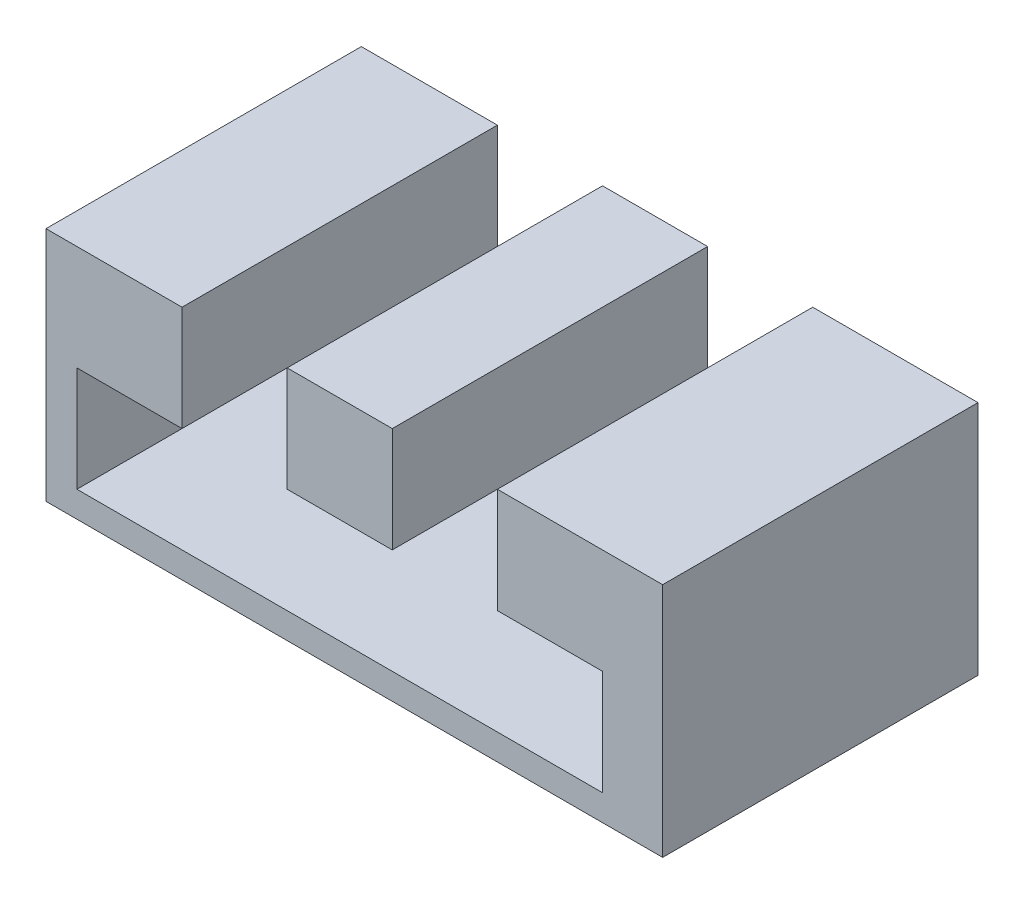
ISO-10303-21;
HEADER;
FILE_DESCRIPTION(('STEP AP214'),'2;1');
FILE_NAME('part.step','',(''),(''),'','','');
FILE_SCHEMA(('AUTOMOTIVE_DESIGN { 1 0 10303 214 1 1 1 1 }'));
ENDSEC;
DATA;
#1=APPLICATION_CONTEXT('core data for automotive mechanical design processes');
#2=APPLICATION_PROTOCOL_DEFINITION('international standard','automotive_design',2000,#1);
#3=PRODUCT_CONTEXT('',#1,'mechanical');
#4=PRODUCT('Part','Part','',(#3));
#5=PRODUCT_RELATED_PRODUCT_CATEGORY('part','',(#4));
#6=PRODUCT_DEFINITION_FORMATION('','',#4);
#7=PRODUCT_DEFINITION_CONTEXT('part definition',#1,'design');
#8=PRODUCT_DEFINITION('design','',#6,#7);
#9=PRODUCT_DEFINITION_SHAPE('','',#8);
#10=(LENGTH_UNIT() NAMED_UNIT(*) SI_UNIT(.MILLI.,.METRE.));
#11=(NAMED_UNIT(*) PLANE_ANGLE_UNIT() SI_UNIT($,.RADIAN.));
#12=(NAMED_UNIT(*) SI_UNIT($,.STERADIAN.) SOLID_ANGLE_UNIT());
#13=UNCERTAINTY_MEASURE_WITH_UNIT(LENGTH_MEASURE(1.E-05),#10,'distance_accuracy_value','');
#14=(GEOMETRIC_REPRESENTATION_CONTEXT(3) GLOBAL_UNCERTAINTY_ASSIGNED_CONTEXT((#13)) GLOBAL_UNIT_ASSIGNED_CONTEXT((#10,
#11,#12)) REPRESENTATION_CONTEXT('',''));
#15=CARTESIAN_POINT('',(0.,0.,0.));
#16=DIRECTION('',(0.,0.,1.));
#17=DIRECTION('',(1.,0.,0.));
#18=AXIS2_PLACEMENT_3D('',#15,#16,#17);
#19=CARTESIAN_POINT('',(-2.94320706898933,20.,30.));
#20=DIRECTION('',(0.,-1.,0.));
#21=DIRECTION('',(0.,0.,-1.));
#22=AXIS2_PLACEMENT_3D('',#19,#20,#21);
#23=PLANE('',#22);
#24=DIRECTION('',(0.,0.,-1.));
#25=VECTOR('',#24,1.);
#26=CARTESIAN_POINT('',(40.,20.,30.));
#27=LINE('',#26,#25);
#28=CARTESIAN_POINT('',(40.,20.,30.));
#29=VERTEX_POINT('',#28);
#30=CARTESIAN_POINT('',(40.,20.,0.));
#31=VERTEX_POINT('',#30);
#32=EDGE_CURVE('E206',#29,#31,#27,.T.);
#33=ORIENTED_EDGE('',*,*,#32,.F.);
#34=DIRECTION('',(-1.,0.,0.));
#35=VECTOR('',#34,1.);
#36=CARTESIAN_POINT('',(-2.94320706898933,20.,30.));
#37=LINE('',#36,#35);
#38=CARTESIAN_POINT('',(55.7217406532504,20.,30.));
#39=VERTEX_POINT('',#38);
#40=EDGE_CURVE('E159',#39,#29,#37,.T.);
#41=ORIENTED_EDGE('',*,*,#40,.F.);
#42=DIRECTION('',(0.,0.,-1.));
#43=VECTOR('',#42,1.);
#44=CARTESIAN_POINT('',(55.7217406532504,20.,30.));
#45=LINE('',#44,#43);
#46=CARTESIAN_POINT('',(55.7217406532504,20.,0.));
#47=VERTEX_POINT('',#46);
#48=EDGE_CURVE('E184',#39,#47,#45,.T.);
#49=ORIENTED_EDGE('',*,*,#48,.T.);
#50=DIRECTION('',(-1.,0.,0.));
#51=VECTOR('',#50,1.);
#52=CARTESIAN_POINT('',(-2.94320706898933,20.,0.));
#53=LINE('',#52,#51);
#54=EDGE_CURVE('E46',#47,#31,#53,.T.);
#55=ORIENTED_EDGE('',*,*,#54,.T.);
#56=EDGE_LOOP('',(#33,#41,#49,#55));
#57=FACE_BOUND('',#56,.T.);
#58=ADVANCED_FACE('F43',(#57),#23,.F.);
#59=DIRECTION('',(0.,0.,-1.));
#60=VECTOR('',#59,1.);
#61=CARTESIAN_POINT('',(10.,20.,30.));
#62=LINE('',#61,#60);
#63=CARTESIAN_POINT('',(10.,20.,30.));
#64=VERTEX_POINT('',#63);
#65=CARTESIAN_POINT('',(10.,20.,0.));
#66=VERTEX_POINT('',#65);
#67=EDGE_CURVE('E177',#64,#66,#62,.T.);
#68=ORIENTED_EDGE('',*,*,#67,.T.);
#69=CARTESIAN_POINT('',(-2.94320706898933,20.,0.));
#70=VERTEX_POINT('',#69);
#71=EDGE_CURVE('E171',#66,#70,#53,.T.);
#72=ORIENTED_EDGE('',*,*,#71,.T.);
#73=DIRECTION('',(0.,0.,-1.));
#74=VECTOR('',#73,1.);
#75=CARTESIAN_POINT('',(-2.94320706898933,20.,30.));
#76=LINE('',#75,#74);
#77=CARTESIAN_POINT('',(-2.94320706898933,20.,30.));
#78=VERTEX_POINT('',#77);
#79=EDGE_CURVE('E195',#78,#70,#76,.T.);
#80=ORIENTED_EDGE('',*,*,#79,.F.);
#81=EDGE_CURVE('E163',#64,#78,#37,.T.);
#82=ORIENTED_EDGE('',*,*,#81,.F.);
#83=EDGE_LOOP('',(#68,#72,#80,#82));
#84=FACE_BOUND('',#83,.T.);
#85=ADVANCED_FACE('F233',(#84),#23,.F.);
#86=CARTESIAN_POINT('',(0.,0.,30.));
#87=DIRECTION('',(0.,0.,-1.));
#88=DIRECTION('',(-1.,0.,0.));
#89=AXIS2_PLACEMENT_3D('',#86,#87,#88);
#90=PLANE('',#89);
#91=DIRECTION('',(0.,1.,0.));
#92=VECTOR('',#91,1.);
#93=CARTESIAN_POINT('',(40.,10.,30.));
#94=LINE('',#93,#92);
#95=CARTESIAN_POINT('',(40.,10.,30.));
#96=VERTEX_POINT('',#95);
#97=EDGE_CURVE('E207',#96,#29,#94,.T.);
#98=ORIENTED_EDGE('',*,*,#97,.F.);
#99=DIRECTION('',(-1.,0.,0.));
#100=VECTOR('',#99,1.);
#101=CARTESIAN_POINT('',(50.,10.,30.));
#102=LINE('',#101,#100);
#103=CARTESIAN_POINT('',(50.,10.,30.));
#104=VERTEX_POINT('',#103);
#105=EDGE_CURVE('E151',#104,#96,#102,.T.);
#106=ORIENTED_EDGE('',*,*,#105,.F.);
#107=DIRECTION('',(0.,1.,0.));
#108=VECTOR('',#107,1.);
#109=CARTESIAN_POINT('',(50.,0.,30.));
#110=LINE('',#109,#108);
#111=CARTESIAN_POINT('',(50.,0.,30.));
#112=VERTEX_POINT('',#111);
#113=EDGE_CURVE('E142',#112,#104,#110,.T.);
#114=ORIENTED_EDGE('',*,*,#113,.F.);
#115=DIRECTION('',(1.,0.,0.));
#116=VECTOR('',#115,1.);
#117=CARTESIAN_POINT('',(0.,0.,30.));
#118=LINE('',#117,#116);
#119=CARTESIAN_POINT('',(0.,0.,30.));
#120=VERTEX_POINT('',#119);
#121=EDGE_CURVE('E131',#120,#112,#118,.T.);
#122=ORIENTED_EDGE('',*,*,#121,.F.);
#123=DIRECTION('',(0.,-1.,0.));
#124=VECTOR('',#123,1.);
#125=CARTESIAN_POINT('',(0.,10.,30.));
#126=LINE('',#125,#124);
#127=CARTESIAN_POINT('',(0.,10.,30.));
#128=VERTEX_POINT('',#127);
#129=EDGE_CURVE('E51',#128,#120,#126,.T.);
#130=ORIENTED_EDGE('',*,*,#129,.F.);
#131=DIRECTION('',(-1.,0.,0.));
#132=VECTOR('',#131,1.);
#133=CARTESIAN_POINT('',(10.,10.,30.));
#134=LINE('',#133,#132);
#135=CARTESIAN_POINT('',(10.,10.,30.));
#136=VERTEX_POINT('',#135);
#137=EDGE_CURVE('E214',#136,#128,#134,.T.);
#138=ORIENTED_EDGE('',*,*,#137,.F.);
#139=DIRECTION('',(0.,-1.,0.));
#140=VECTOR('',#139,1.);
#141=CARTESIAN_POINT('',(10.,20.,30.));
#142=LINE('',#141,#140);
#143=EDGE_CURVE('E211',#64,#136,#142,.T.);
#144=ORIENTED_EDGE('',*,*,#143,.F.);
#145=ORIENTED_EDGE('',*,*,#81,.T.);
#146=DIRECTION('',(0.,-1.,0.));
#147=VECTOR('',#146,1.);
#148=CARTESIAN_POINT('',(-2.94320706898933,-2.47182688389919,30.));
#149=LINE('',#148,#147);
#150=CARTESIAN_POINT('',(-2.94320706898933,-2.47182688389919,30.));
#151=VERTEX_POINT('',#150);
#152=EDGE_CURVE('E170',#78,#151,#149,.T.);
#153=ORIENTED_EDGE('',*,*,#152,.T.);
#154=DIRECTION('',(1.,0.,0.));
#155=VECTOR('',#154,1.);
#156=CARTESIAN_POINT('',(-2.94320706898933,-2.47182688389919,30.));
#157=LINE('',#156,#155);
#158=CARTESIAN_POINT('',(55.7217406532504,-2.47182688389919,30.));
#159=VERTEX_POINT('',#158);
#160=EDGE_CURVE('E168',#151,#159,#157,.T.);
#161=ORIENTED_EDGE('',*,*,#160,.T.);
#162=DIRECTION('',(0.,1.,0.));
#163=VECTOR('',#162,1.);
#164=CARTESIAN_POINT('',(55.7217406532504,-2.47182688389919,30.));
#165=LINE('',#164,#163);
#166=EDGE_CURVE('E162',#159,#39,#165,.T.);
#167=ORIENTED_EDGE('',*,*,#166,.T.);
#168=ORIENTED_EDGE('',*,*,#40,.T.);
#169=EDGE_LOOP('',(#98,#106,#114,#122,#130,#138,#144,#145,#153,#161,#167,#168));
#170=FACE_BOUND('',#169,.T.);
#171=ADVANCED_FACE('F150',(#170),#90,.F.);
#172=CARTESIAN_POINT('',(0.,0.,0.));
#173=DIRECTION('',(0.,0.,-1.));
#174=DIRECTION('',(-1.,0.,0.));
#175=AXIS2_PLACEMENT_3D('',#172,#173,#174);
#176=PLANE('',#175);
#177=DIRECTION('',(-1.,0.,0.));
#178=VECTOR('',#177,1.);
#179=CARTESIAN_POINT('',(50.,10.,0.));
#180=LINE('',#179,#178);
#181=CARTESIAN_POINT('',(50.,10.,0.));
#182=VERTEX_POINT('',#181);
#183=CARTESIAN_POINT('',(40.,10.,0.));
#184=VERTEX_POINT('',#183);
#185=EDGE_CURVE('E161',#182,#184,#180,.T.);
#186=ORIENTED_EDGE('',*,*,#185,.T.);
#187=DIRECTION('',(0.,1.,0.));
#188=VECTOR('',#187,1.);
#189=CARTESIAN_POINT('',(40.,10.,0.));
#190=LINE('',#189,#188);
#191=EDGE_CURVE('E166',#184,#31,#190,.T.);
#192=ORIENTED_EDGE('',*,*,#191,.T.);
#193=ORIENTED_EDGE('',*,*,#54,.F.);
#194=DIRECTION('',(0.,1.,0.));
#195=VECTOR('',#194,1.);
#196=CARTESIAN_POINT('',(55.7217406532504,-2.47182688389919,0.));
#197=LINE('',#196,#195);
#198=CARTESIAN_POINT('',(55.7217406532504,-2.47182688389919,0.));
#199=VERTEX_POINT('',#198);
#200=EDGE_CURVE('E199',#199,#47,#197,.T.);
#201=ORIENTED_EDGE('',*,*,#200,.F.);
#202=DIRECTION('',(1.,0.,0.));
#203=VECTOR('',#202,1.);
#204=CARTESIAN_POINT('',(-2.94320706898933,-2.47182688389919,0.));
#205=LINE('',#204,#203);
#206=CARTESIAN_POINT('',(-2.94320706898933,-2.47182688389919,0.));
#207=VERTEX_POINT('',#206);
#208=EDGE_CURVE('E197',#207,#199,#205,.T.);
#209=ORIENTED_EDGE('',*,*,#208,.F.);
#210=DIRECTION('',(0.,-1.,0.));
#211=VECTOR('',#210,1.);
#212=CARTESIAN_POINT('',(-2.94320706898933,-2.47182688389919,0.));
#213=LINE('',#212,#211);
#214=EDGE_CURVE('E198',#70,#207,#213,.T.);
#215=ORIENTED_EDGE('',*,*,#214,.F.);
#216=ORIENTED_EDGE('',*,*,#71,.F.);
#217=DIRECTION('',(0.,-1.,0.));
#218=VECTOR('',#217,1.);
#219=CARTESIAN_POINT('',(10.,20.,0.));
#220=LINE('',#219,#218);
#221=CARTESIAN_POINT('',(10.,10.,0.));
#222=VERTEX_POINT('',#221);
#223=EDGE_CURVE('E218',#66,#222,#220,.T.);
#224=ORIENTED_EDGE('',*,*,#223,.T.);
#225=DIRECTION('',(-1.,0.,0.));
#226=VECTOR('',#225,1.);
#227=CARTESIAN_POINT('',(10.,10.,0.));
#228=LINE('',#227,#226);
#229=CARTESIAN_POINT('',(0.,10.,0.));
#230=VERTEX_POINT('',#229);
#231=EDGE_CURVE('E215',#222,#230,#228,.T.);
#232=ORIENTED_EDGE('',*,*,#231,.T.);
#233=DIRECTION('',(0.,-1.,0.));
#234=VECTOR('',#233,1.);
#235=CARTESIAN_POINT('',(0.,10.,0.));
#236=LINE('',#235,#234);
#237=CARTESIAN_POINT('',(0.,0.,0.));
#238=VERTEX_POINT('',#237);
#239=EDGE_CURVE('E63',#230,#238,#236,.T.);
#240=ORIENTED_EDGE('',*,*,#239,.T.);
#241=DIRECTION('',(1.,0.,0.));
#242=VECTOR('',#241,1.);
#243=CARTESIAN_POINT('',(0.,0.,0.));
#244=LINE('',#243,#242);
#245=CARTESIAN_POINT('',(50.,0.,0.));
#246=VERTEX_POINT('',#245);
#247=EDGE_CURVE('E224',#238,#246,#244,.T.);
#248=ORIENTED_EDGE('',*,*,#247,.T.);
#249=DIRECTION('',(0.,1.,0.));
#250=VECTOR('',#249,1.);
#251=CARTESIAN_POINT('',(50.,0.,0.));
#252=LINE('',#251,#250);
#253=EDGE_CURVE('E145',#246,#182,#252,.T.);
#254=ORIENTED_EDGE('',*,*,#253,.T.);
#255=EDGE_LOOP('',(#186,#192,#193,#201,#209,#215,#216,#224,#232,#240,#248,#254));
#256=FACE_BOUND('',#255,.T.);
#257=ADVANCED_FACE('F240',(#256),#176,.T.);
#258=CARTESIAN_POINT('',(-2.94320706898933,-2.47182688389919,30.));
#259=DIRECTION('',(1.,0.,0.));
#260=DIRECTION('',(0.,0.,-1.));
#261=AXIS2_PLACEMENT_3D('',#258,#259,#260);
#262=PLANE('',#261);
#263=ORIENTED_EDGE('',*,*,#214,.T.);
#264=DIRECTION('',(0.,0.,-1.));
#265=VECTOR('',#264,1.);
#266=CARTESIAN_POINT('',(-2.94320706898933,-2.47182688389919,30.));
#267=LINE('',#266,#265);
#268=EDGE_CURVE('E201',#151,#207,#267,.T.);
#269=ORIENTED_EDGE('',*,*,#268,.F.);
#270=ORIENTED_EDGE('',*,*,#152,.F.);
#271=ORIENTED_EDGE('',*,*,#79,.T.);
#272=EDGE_LOOP('',(#263,#269,#270,#271));
#273=FACE_BOUND('',#272,.T.);
#274=ADVANCED_FACE('F249',(#273),#262,.F.);
#275=CARTESIAN_POINT('',(-2.94320706898933,-2.47182688389919,30.));
#276=DIRECTION('',(0.,1.,0.));
#277=DIRECTION('',(0.,0.,1.));
#278=AXIS2_PLACEMENT_3D('',#275,#276,#277);
#279=PLANE('',#278);
#280=ORIENTED_EDGE('',*,*,#208,.T.);
#281=DIRECTION('',(0.,0.,-1.));
#282=VECTOR('',#281,1.);
#283=CARTESIAN_POINT('',(55.7217406532504,-2.47182688389919,30.));
#284=LINE('',#283,#282);
#285=EDGE_CURVE('E193',#159,#199,#284,.T.);
#286=ORIENTED_EDGE('',*,*,#285,.F.);
#287=ORIENTED_EDGE('',*,*,#160,.F.);
#288=ORIENTED_EDGE('',*,*,#268,.T.);
#289=EDGE_LOOP('',(#280,#286,#287,#288));
#290=FACE_BOUND('',#289,.T.);
#291=ADVANCED_FACE('F255',(#290),#279,.F.);
#292=CARTESIAN_POINT('',(55.7217406532504,-2.47182688389919,30.));
#293=DIRECTION('',(-1.,0.,0.));
#294=DIRECTION('',(0.,0.,1.));
#295=AXIS2_PLACEMENT_3D('',#292,#293,#294);
#296=PLANE('',#295);
#297=ORIENTED_EDGE('',*,*,#200,.T.);
#298=ORIENTED_EDGE('',*,*,#48,.F.);
#299=ORIENTED_EDGE('',*,*,#166,.F.);
#300=ORIENTED_EDGE('',*,*,#285,.T.);
#301=EDGE_LOOP('',(#297,#298,#299,#300));
#302=FACE_BOUND('',#301,.T.);
#303=ADVANCED_FACE('F257',(#302),#296,.F.);
#304=CARTESIAN_POINT('',(10.,10.,30.));
#305=DIRECTION('',(0.,-1.,0.));
#306=DIRECTION('',(1.,0.,0.));
#307=AXIS2_PLACEMENT_3D('',#304,#305,#306);
#308=PLANE('',#307);
#309=ORIENTED_EDGE('',*,*,#231,.F.);
#310=DIRECTION('',(0.,0.,-1.));
#311=VECTOR('',#310,1.);
#312=CARTESIAN_POINT('',(10.,10.,30.));
#313=LINE('',#312,#311);
#314=EDGE_CURVE('E209',#136,#222,#313,.T.);
#315=ORIENTED_EDGE('',*,*,#314,.F.);
#316=ORIENTED_EDGE('',*,*,#137,.T.);
#317=DIRECTION('',(0.,0.,-1.));
#318=VECTOR('',#317,1.);
#319=CARTESIAN_POINT('',(0.,10.,30.));
#320=LINE('',#319,#318);
#321=EDGE_CURVE('E212',#128,#230,#320,.T.);
#322=ORIENTED_EDGE('',*,*,#321,.T.);
#323=EDGE_LOOP('',(#309,#315,#316,#322));
#324=FACE_BOUND('',#323,.T.);
#325=ADVANCED_FACE('F274',(#324),#308,.T.);
#326=CARTESIAN_POINT('',(10.,20.,30.));
#327=DIRECTION('',(1.,0.,0.));
#328=DIRECTION('',(0.,1.,0.));
#329=AXIS2_PLACEMENT_3D('',#326,#327,#328);
#330=PLANE('',#329);
#331=ORIENTED_EDGE('',*,*,#223,.F.);
#332=ORIENTED_EDGE('',*,*,#67,.F.);
#333=ORIENTED_EDGE('',*,*,#143,.T.);
#334=ORIENTED_EDGE('',*,*,#314,.T.);
#335=EDGE_LOOP('',(#331,#332,#333,#334));
#336=FACE_BOUND('',#335,.T.);
#337=ADVANCED_FACE('F268',(#336),#330,.T.);
#338=CARTESIAN_POINT('',(40.,10.,30.));
#339=DIRECTION('',(-1.,0.,0.));
#340=DIRECTION('',(0.,0.,1.));
#341=AXIS2_PLACEMENT_3D('',#338,#339,#340);
#342=PLANE('',#341);
#343=ORIENTED_EDGE('',*,*,#191,.F.);
#344=DIRECTION('',(0.,0.,-1.));
#345=VECTOR('',#344,1.);
#346=CARTESIAN_POINT('',(40.,10.,30.));
#347=LINE('',#346,#345);
#348=EDGE_CURVE('E152',#96,#184,#347,.T.);
#349=ORIENTED_EDGE('',*,*,#348,.F.);
#350=ORIENTED_EDGE('',*,*,#97,.T.);
#351=ORIENTED_EDGE('',*,*,#32,.T.);
#352=EDGE_LOOP('',(#343,#349,#350,#351));
#353=FACE_BOUND('',#352,.T.);
#354=ADVANCED_FACE('F231',(#353),#342,.T.);
#355=CARTESIAN_POINT('',(50.,10.,30.));
#356=DIRECTION('',(0.,-1.,0.));
#357=DIRECTION('',(0.,0.,-1.));
#358=AXIS2_PLACEMENT_3D('',#355,#356,#357);
#359=PLANE('',#358);
#360=ORIENTED_EDGE('',*,*,#185,.F.);
#361=DIRECTION('',(0.,0.,-1.));
#362=VECTOR('',#361,1.);
#363=CARTESIAN_POINT('',(50.,10.,30.));
#364=LINE('',#363,#362);
#365=EDGE_CURVE('E138',#104,#182,#364,.T.);
#366=ORIENTED_EDGE('',*,*,#365,.F.);
#367=ORIENTED_EDGE('',*,*,#105,.T.);
#368=ORIENTED_EDGE('',*,*,#348,.T.);
#369=EDGE_LOOP('',(#360,#366,#367,#368));
#370=FACE_BOUND('',#369,.T.);
#371=ADVANCED_FACE('F260',(#370),#359,.T.);
#372=CARTESIAN_POINT('',(50.,0.,30.));
#373=DIRECTION('',(-1.,0.,0.));
#374=DIRECTION('',(0.,0.,1.));
#375=AXIS2_PLACEMENT_3D('',#372,#373,#374);
#376=PLANE('',#375);
#377=ORIENTED_EDGE('',*,*,#253,.F.);
#378=DIRECTION('',(0.,0.,-1.));
#379=VECTOR('',#378,1.);
#380=CARTESIAN_POINT('',(50.,0.,30.));
#381=LINE('',#380,#379);
#382=EDGE_CURVE('E134',#112,#246,#381,.T.);
#383=ORIENTED_EDGE('',*,*,#382,.F.);
#384=ORIENTED_EDGE('',*,*,#113,.T.);
#385=ORIENTED_EDGE('',*,*,#365,.T.);
#386=EDGE_LOOP('',(#377,#383,#384,#385));
#387=FACE_BOUND('',#386,.T.);
#388=ADVANCED_FACE('F141',(#387),#376,.T.);
#389=CARTESIAN_POINT('',(0.,0.,30.));
#390=DIRECTION('',(0.,1.,0.));
#391=DIRECTION('',(0.,0.,1.));
#392=AXIS2_PLACEMENT_3D('',#389,#390,#391);
#393=PLANE('',#392);
#394=ORIENTED_EDGE('',*,*,#247,.F.);
#395=DIRECTION('',(0.,0.,-1.));
#396=VECTOR('',#395,1.);
#397=CARTESIAN_POINT('',(0.,0.,30.));
#398=LINE('',#397,#396);
#399=EDGE_CURVE('E12',#120,#238,#398,.T.);
#400=ORIENTED_EDGE('',*,*,#399,.F.);
#401=ORIENTED_EDGE('',*,*,#121,.T.);
#402=ORIENTED_EDGE('',*,*,#382,.T.);
#403=EDGE_LOOP('',(#394,#400,#401,#402));
#404=FACE_BOUND('',#403,.T.);
#405=ADVANCED_FACE('F133',(#404),#393,.T.);
#406=CARTESIAN_POINT('',(0.,10.,30.));
#407=DIRECTION('',(1.,0.,0.));
#408=DIRECTION('',(0.,1.,0.));
#409=AXIS2_PLACEMENT_3D('',#406,#407,#408);
#410=PLANE('',#409);
#411=ORIENTED_EDGE('',*,*,#239,.F.);
#412=ORIENTED_EDGE('',*,*,#321,.F.);
#413=ORIENTED_EDGE('',*,*,#129,.T.);
#414=ORIENTED_EDGE('',*,*,#399,.T.);
#415=EDGE_LOOP('',(#411,#412,#413,#414));
#416=FACE_BOUND('',#415,.T.);
#417=ADVANCED_FACE('F289',(#416),#410,.T.);
#418=CLOSED_SHELL('',(#58,#85,#171,#257,#274,#291,#303,#325,#337,#354,#371,#388,#405,#417));
#419=MANIFOLD_SOLID_BREP('B2',#418);
#420=CARTESIAN_POINT('',(0.,0.,30.));
#421=DIRECTION('',(0.,0.,-1.));
#422=DIRECTION('',(-1.,0.,0.));
#423=AXIS2_PLACEMENT_3D('',#420,#421,#422);
#424=PLANE('',#423);
#425=DIRECTION('',(0.,-1.,0.));
#426=VECTOR('',#425,1.);
#427=CARTESIAN_POINT('',(30.,20.,30.));
#428=LINE('',#427,#426);
#429=CARTESIAN_POINT('',(30.,20.,30.));
#430=VERTEX_POINT('',#429);
#431=CARTESIAN_POINT('',(30.,10.,30.));
#432=VERTEX_POINT('',#431);
#433=EDGE_CURVE('E417',#430,#432,#428,.T.);
#434=ORIENTED_EDGE('',*,*,#433,.F.);
#435=DIRECTION('',(-1.,0.,0.));
#436=VECTOR('',#435,1.);
#437=CARTESIAN_POINT('',(-2.94320706898933,20.,30.));
#438=LINE('',#437,#436);
#439=CARTESIAN_POINT('',(20.,20.,30.));
#440=VERTEX_POINT('',#439);
#441=EDGE_CURVE('E41',#430,#440,#438,.T.);
#442=ORIENTED_EDGE('',*,*,#441,.T.);
#443=DIRECTION('',(0.,1.,0.));
#444=VECTOR('',#443,1.);
#445=CARTESIAN_POINT('',(20.,10.,30.));
#446=LINE('',#445,#444);
#447=CARTESIAN_POINT('',(20.,10.,30.));
#448=VERTEX_POINT('',#447);
#449=EDGE_CURVE('E393',#448,#440,#446,.T.);
#450=ORIENTED_EDGE('',*,*,#449,.F.);
#451=DIRECTION('',(-1.,0.,0.));
#452=VECTOR('',#451,1.);
#453=CARTESIAN_POINT('',(30.,10.,30.));
#454=LINE('',#453,#452);
#455=EDGE_CURVE('E424',#432,#448,#454,.T.);
#456=ORIENTED_EDGE('',*,*,#455,.F.);
#457=EDGE_LOOP('',(#434,#442,#450,#456));
#458=FACE_BOUND('',#457,.T.);
#459=ADVANCED_FACE('F372',(#458),#424,.F.);
#460=CARTESIAN_POINT('',(0.,0.,0.));
#461=DIRECTION('',(0.,0.,-1.));
#462=DIRECTION('',(-1.,0.,0.));
#463=AXIS2_PLACEMENT_3D('',#460,#461,#462);
#464=PLANE('',#463);
#465=DIRECTION('',(-1.,0.,0.));
#466=VECTOR('',#465,1.);
#467=CARTESIAN_POINT('',(-2.94320706898933,20.,0.));
#468=LINE('',#467,#466);
#469=CARTESIAN_POINT('',(30.,20.,0.));
#470=VERTEX_POINT('',#469);
#471=CARTESIAN_POINT('',(20.,20.,0.));
#472=VERTEX_POINT('',#471);
#473=EDGE_CURVE('E376',#470,#472,#468,.T.);
#474=ORIENTED_EDGE('',*,*,#473,.F.);
#475=DIRECTION('',(0.,-1.,0.));
#476=VECTOR('',#475,1.);
#477=CARTESIAN_POINT('',(30.,20.,0.));
#478=LINE('',#477,#476);
#479=CARTESIAN_POINT('',(30.,10.,0.));
#480=VERTEX_POINT('',#479);
#481=EDGE_CURVE('E435',#470,#480,#478,.T.);
#482=ORIENTED_EDGE('',*,*,#481,.T.);
#483=DIRECTION('',(-1.,0.,0.));
#484=VECTOR('',#483,1.);
#485=CARTESIAN_POINT('',(30.,10.,0.));
#486=LINE('',#485,#484);
#487=CARTESIAN_POINT('',(20.,10.,0.));
#488=VERTEX_POINT('',#487);
#489=EDGE_CURVE('E429',#480,#488,#486,.T.);
#490=ORIENTED_EDGE('',*,*,#489,.T.);
#491=DIRECTION('',(0.,1.,0.));
#492=VECTOR('',#491,1.);
#493=CARTESIAN_POINT('',(20.,10.,0.));
#494=LINE('',#493,#492);
#495=EDGE_CURVE('E425',#488,#472,#494,.T.);
#496=ORIENTED_EDGE('',*,*,#495,.T.);
#497=EDGE_LOOP('',(#474,#482,#490,#496));
#498=FACE_BOUND('',#497,.T.);
#499=ADVANCED_FACE('F445',(#498),#464,.T.);
#500=CARTESIAN_POINT('',(-2.94320706898933,20.,30.));
#501=DIRECTION('',(0.,-1.,0.));
#502=DIRECTION('',(0.,0.,-1.));
#503=AXIS2_PLACEMENT_3D('',#500,#501,#502);
#504=PLANE('',#503);
#505=DIRECTION('',(0.,0.,-1.));
#506=VECTOR('',#505,1.);
#507=CARTESIAN_POINT('',(30.,20.,30.));
#508=LINE('',#507,#506);
#509=EDGE_CURVE('E415',#430,#470,#508,.T.);
#510=ORIENTED_EDGE('',*,*,#509,.T.);
#511=ORIENTED_EDGE('',*,*,#473,.T.);
#512=DIRECTION('',(0.,0.,-1.));
#513=VECTOR('',#512,1.);
#514=CARTESIAN_POINT('',(20.,20.,30.));
#515=LINE('',#514,#513);
#516=EDGE_CURVE('E387',#440,#472,#515,.T.);
#517=ORIENTED_EDGE('',*,*,#516,.F.);
#518=ORIENTED_EDGE('',*,*,#441,.F.);
#519=EDGE_LOOP('',(#510,#511,#517,#518));
#520=FACE_BOUND('',#519,.T.);
#521=ADVANCED_FACE('F374',(#520),#504,.F.);
#522=CARTESIAN_POINT('',(30.,20.,30.));
#523=DIRECTION('',(1.,0.,0.));
#524=DIRECTION('',(0.,0.,-1.));
#525=AXIS2_PLACEMENT_3D('',#522,#523,#524);
#526=PLANE('',#525);
#527=ORIENTED_EDGE('',*,*,#481,.F.);
#528=ORIENTED_EDGE('',*,*,#509,.F.);
#529=ORIENTED_EDGE('',*,*,#433,.T.);
#530=DIRECTION('',(0.,0.,-1.));
#531=VECTOR('',#530,1.);
#532=CARTESIAN_POINT('',(30.,10.,30.));
#533=LINE('',#532,#531);
#534=EDGE_CURVE('E420',#432,#480,#533,.T.);
#535=ORIENTED_EDGE('',*,*,#534,.T.);
#536=EDGE_LOOP('',(#527,#528,#529,#535));
#537=FACE_BOUND('',#536,.T.);
#538=ADVANCED_FACE('F419',(#537),#526,.T.);
#539=CARTESIAN_POINT('',(30.,10.,30.));
#540=DIRECTION('',(0.,-1.,0.));
#541=DIRECTION('',(1.,0.,0.));
#542=AXIS2_PLACEMENT_3D('',#539,#540,#541);
#543=PLANE('',#542);
#544=ORIENTED_EDGE('',*,*,#489,.F.);
#545=ORIENTED_EDGE('',*,*,#534,.F.);
#546=ORIENTED_EDGE('',*,*,#455,.T.);
#547=DIRECTION('',(0.,0.,-1.));
#548=VECTOR('',#547,1.);
#549=CARTESIAN_POINT('',(20.,10.,30.));
#550=LINE('',#549,#548);
#551=EDGE_CURVE('E409',#448,#488,#550,.T.);
#552=ORIENTED_EDGE('',*,*,#551,.T.);
#553=EDGE_LOOP('',(#544,#545,#546,#552));
#554=FACE_BOUND('',#553,.T.);
#555=ADVANCED_FACE('F427',(#554),#543,.T.);
#556=CARTESIAN_POINT('',(20.,10.,30.));
#557=DIRECTION('',(-1.,0.,0.));
#558=DIRECTION('',(0.,-1.,0.));
#559=AXIS2_PLACEMENT_3D('',#556,#557,#558);
#560=PLANE('',#559);
#561=ORIENTED_EDGE('',*,*,#495,.F.);
#562=ORIENTED_EDGE('',*,*,#551,.F.);
#563=ORIENTED_EDGE('',*,*,#449,.T.);
#564=ORIENTED_EDGE('',*,*,#516,.T.);
#565=EDGE_LOOP('',(#561,#562,#563,#564));
#566=FACE_BOUND('',#565,.T.);
#567=ADVANCED_FACE('F446',(#566),#560,.T.);
#568=CLOSED_SHELL('',(#459,#499,#521,#538,#555,#567));
#569=MANIFOLD_SOLID_BREP('B6',#568);
#570=ADVANCED_BREP_SHAPE_REPRESENTATION('',(#18,#419,#569),#14);
#571=SHAPE_DEFINITION_REPRESENTATION(#9,#570);
ENDSEC;
END-ISO-10303-21;
